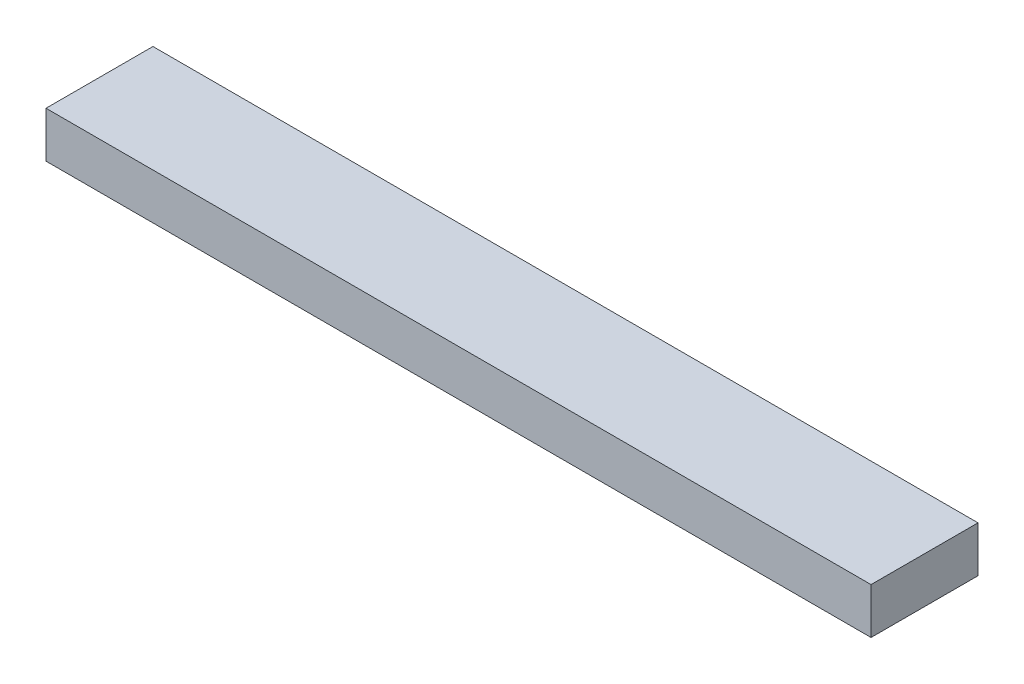
ISO-10303-21;
HEADER;
FILE_DESCRIPTION(('STEP AP214'),'2;1');
FILE_NAME('part.step','',(''),(''),'','','');
FILE_SCHEMA(('AUTOMOTIVE_DESIGN { 1 0 10303 214 1 1 1 1 }'));
ENDSEC;
DATA;
#1=APPLICATION_CONTEXT('core data for automotive mechanical design processes');
#2=APPLICATION_PROTOCOL_DEFINITION('international standard','automotive_design',2000,#1);
#3=PRODUCT_CONTEXT('',#1,'mechanical');
#4=PRODUCT('Part','Part','',(#3));
#5=PRODUCT_RELATED_PRODUCT_CATEGORY('part','',(#4));
#6=PRODUCT_DEFINITION_FORMATION('','',#4);
#7=PRODUCT_DEFINITION_CONTEXT('part definition',#1,'design');
#8=PRODUCT_DEFINITION('design','',#6,#7);
#9=PRODUCT_DEFINITION_SHAPE('','',#8);
#10=(LENGTH_UNIT() NAMED_UNIT(*) SI_UNIT(.MILLI.,.METRE.));
#11=(NAMED_UNIT(*) PLANE_ANGLE_UNIT() SI_UNIT($,.RADIAN.));
#12=(NAMED_UNIT(*) SI_UNIT($,.STERADIAN.) SOLID_ANGLE_UNIT());
#13=UNCERTAINTY_MEASURE_WITH_UNIT(LENGTH_MEASURE(1.E-05),#10,'distance_accuracy_value','');
#14=(GEOMETRIC_REPRESENTATION_CONTEXT(3) GLOBAL_UNCERTAINTY_ASSIGNED_CONTEXT((#13)) GLOBAL_UNIT_ASSIGNED_CONTEXT((#10,
#11,#12)) REPRESENTATION_CONTEXT('',''));
#15=CARTESIAN_POINT('',(0.,0.,0.));
#16=DIRECTION('',(0.,0.,1.));
#17=DIRECTION('',(1.,0.,0.));
#18=AXIS2_PLACEMENT_3D('',#15,#16,#17);
#19=CARTESIAN_POINT('',(0.,38.1,0.));
#20=DIRECTION('',(1.,0.,0.));
#21=DIRECTION('',(0.,0.,-1.));
#22=AXIS2_PLACEMENT_3D('',#19,#20,#21);
#23=PLANE('',#22);
#24=DIRECTION('',(0.,0.,1.));
#25=VECTOR('',#24,1.);
#26=CARTESIAN_POINT('',(0.,0.,0.));
#27=LINE('',#26,#25);
#28=CARTESIAN_POINT('',(0.,0.,-88.9));
#29=VERTEX_POINT('',#28);
#30=CARTESIAN_POINT('',(0.,0.,0.));
#31=VERTEX_POINT('',#30);
#32=EDGE_CURVE('E104',#29,#31,#27,.T.);
#33=ORIENTED_EDGE('',*,*,#32,.T.);
#34=DIRECTION('',(0.,-1.,0.));
#35=VECTOR('',#34,1.);
#36=CARTESIAN_POINT('',(0.,38.1,0.));
#37=LINE('',#36,#35);
#38=CARTESIAN_POINT('',(0.,38.1,0.));
#39=VERTEX_POINT('',#38);
#40=EDGE_CURVE('E11',#39,#31,#37,.T.);
#41=ORIENTED_EDGE('',*,*,#40,.F.);
#42=DIRECTION('',(0.,0.,1.));
#43=VECTOR('',#42,1.);
#44=CARTESIAN_POINT('',(0.,38.1,0.));
#45=LINE('',#44,#43);
#46=CARTESIAN_POINT('',(0.,38.1,-88.9));
#47=VERTEX_POINT('',#46);
#48=EDGE_CURVE('E92',#47,#39,#45,.T.);
#49=ORIENTED_EDGE('',*,*,#48,.F.);
#50=DIRECTION('',(0.,-1.,0.));
#51=VECTOR('',#50,1.);
#52=CARTESIAN_POINT('',(0.,38.1,-88.9));
#53=LINE('',#52,#51);
#54=EDGE_CURVE('E100',#47,#29,#53,.T.);
#55=ORIENTED_EDGE('',*,*,#54,.T.);
#56=EDGE_LOOP('',(#33,#41,#49,#55));
#57=FACE_BOUND('',#56,.T.);
#58=ADVANCED_FACE('F41',(#57),#23,.F.);
#59=CARTESIAN_POINT('',(0.,38.1,0.));
#60=DIRECTION('',(0.,0.,-1.));
#61=DIRECTION('',(-1.,0.,0.));
#62=AXIS2_PLACEMENT_3D('',#59,#60,#61);
#63=PLANE('',#62);
#64=DIRECTION('',(1.,0.,0.));
#65=VECTOR('',#64,1.);
#66=CARTESIAN_POINT('',(0.,0.,0.));
#67=LINE('',#66,#65);
#68=CARTESIAN_POINT('',(685.8,0.,0.));
#69=VERTEX_POINT('',#68);
#70=EDGE_CURVE('E96',#31,#69,#67,.T.);
#71=ORIENTED_EDGE('',*,*,#70,.T.);
#72=DIRECTION('',(0.,-1.,0.));
#73=VECTOR('',#72,1.);
#74=CARTESIAN_POINT('',(685.8,38.1,0.));
#75=LINE('',#74,#73);
#76=CARTESIAN_POINT('',(685.8,38.1,0.));
#77=VERTEX_POINT('',#76);
#78=EDGE_CURVE('E49',#77,#69,#75,.T.);
#79=ORIENTED_EDGE('',*,*,#78,.F.);
#80=DIRECTION('',(1.,0.,0.));
#81=VECTOR('',#80,1.);
#82=CARTESIAN_POINT('',(0.,38.1,0.));
#83=LINE('',#82,#81);
#84=EDGE_CURVE('E87',#39,#77,#83,.T.);
#85=ORIENTED_EDGE('',*,*,#84,.F.);
#86=ORIENTED_EDGE('',*,*,#40,.T.);
#87=EDGE_LOOP('',(#71,#79,#85,#86));
#88=FACE_BOUND('',#87,.T.);
#89=ADVANCED_FACE('F95',(#88),#63,.F.);
#90=CARTESIAN_POINT('',(685.8,38.1,0.));
#91=DIRECTION('',(-1.,0.,0.));
#92=DIRECTION('',(0.,0.,1.));
#93=AXIS2_PLACEMENT_3D('',#90,#91,#92);
#94=PLANE('',#93);
#95=DIRECTION('',(0.,0.,-1.));
#96=VECTOR('',#95,1.);
#97=CARTESIAN_POINT('',(685.8,0.,0.));
#98=LINE('',#97,#96);
#99=CARTESIAN_POINT('',(685.8,0.,-88.9));
#100=VERTEX_POINT('',#99);
#101=EDGE_CURVE('E74',#69,#100,#98,.T.);
#102=ORIENTED_EDGE('',*,*,#101,.T.);
#103=DIRECTION('',(0.,-1.,0.));
#104=VECTOR('',#103,1.);
#105=CARTESIAN_POINT('',(685.8,38.1,-88.9));
#106=LINE('',#105,#104);
#107=CARTESIAN_POINT('',(685.8,38.1,-88.9));
#108=VERTEX_POINT('',#107);
#109=EDGE_CURVE('E97',#108,#100,#106,.T.);
#110=ORIENTED_EDGE('',*,*,#109,.F.);
#111=DIRECTION('',(0.,0.,-1.));
#112=VECTOR('',#111,1.);
#113=CARTESIAN_POINT('',(685.8,38.1,0.));
#114=LINE('',#113,#112);
#115=EDGE_CURVE('E90',#77,#108,#114,.T.);
#116=ORIENTED_EDGE('',*,*,#115,.F.);
#117=ORIENTED_EDGE('',*,*,#78,.T.);
#118=EDGE_LOOP('',(#102,#110,#116,#117));
#119=FACE_BOUND('',#118,.T.);
#120=ADVANCED_FACE('F98',(#119),#94,.F.);
#121=CARTESIAN_POINT('',(0.,38.1,-88.9));
#122=DIRECTION('',(0.,0.,1.));
#123=DIRECTION('',(1.,0.,0.));
#124=AXIS2_PLACEMENT_3D('',#121,#122,#123);
#125=PLANE('',#124);
#126=DIRECTION('',(-1.,0.,0.));
#127=VECTOR('',#126,1.);
#128=CARTESIAN_POINT('',(0.,0.,-88.9));
#129=LINE('',#128,#127);
#130=EDGE_CURVE('E80',#100,#29,#129,.T.);
#131=ORIENTED_EDGE('',*,*,#130,.T.);
#132=ORIENTED_EDGE('',*,*,#54,.F.);
#133=DIRECTION('',(-1.,0.,0.));
#134=VECTOR('',#133,1.);
#135=CARTESIAN_POINT('',(0.,38.1,-88.9));
#136=LINE('',#135,#134);
#137=EDGE_CURVE('E57',#108,#47,#136,.T.);
#138=ORIENTED_EDGE('',*,*,#137,.F.);
#139=ORIENTED_EDGE('',*,*,#109,.T.);
#140=EDGE_LOOP('',(#131,#132,#138,#139));
#141=FACE_BOUND('',#140,.T.);
#142=ADVANCED_FACE('F111',(#141),#125,.F.);
#143=CARTESIAN_POINT('',(0.,38.1,0.));
#144=DIRECTION('',(0.,-1.,0.));
#145=DIRECTION('',(0.,0.,-1.));
#146=AXIS2_PLACEMENT_3D('',#143,#144,#145);
#147=PLANE('',#146);
#148=ORIENTED_EDGE('',*,*,#48,.T.);
#149=ORIENTED_EDGE('',*,*,#84,.T.);
#150=ORIENTED_EDGE('',*,*,#115,.T.);
#151=ORIENTED_EDGE('',*,*,#137,.T.);
#152=EDGE_LOOP('',(#148,#149,#150,#151));
#153=FACE_BOUND('',#152,.T.);
#154=ADVANCED_FACE('F88',(#153),#147,.F.);
#155=CARTESIAN_POINT('',(0.,0.,0.));
#156=DIRECTION('',(0.,-1.,0.));
#157=DIRECTION('',(0.,0.,-1.));
#158=AXIS2_PLACEMENT_3D('',#155,#156,#157);
#159=PLANE('',#158);
#160=ORIENTED_EDGE('',*,*,#32,.F.);
#161=ORIENTED_EDGE('',*,*,#130,.F.);
#162=ORIENTED_EDGE('',*,*,#101,.F.);
#163=ORIENTED_EDGE('',*,*,#70,.F.);
#164=EDGE_LOOP('',(#160,#161,#162,#163));
#165=FACE_BOUND('',#164,.T.);
#166=ADVANCED_FACE('F114',(#165),#159,.T.);
#167=CLOSED_SHELL('',(#58,#89,#120,#142,#154,#166));
#168=MANIFOLD_SOLID_BREP('B2',#167);
#169=ADVANCED_BREP_SHAPE_REPRESENTATION('',(#18,#168),#14);
#170=SHAPE_DEFINITION_REPRESENTATION(#9,#169);
ENDSEC;
END-ISO-10303-21;
